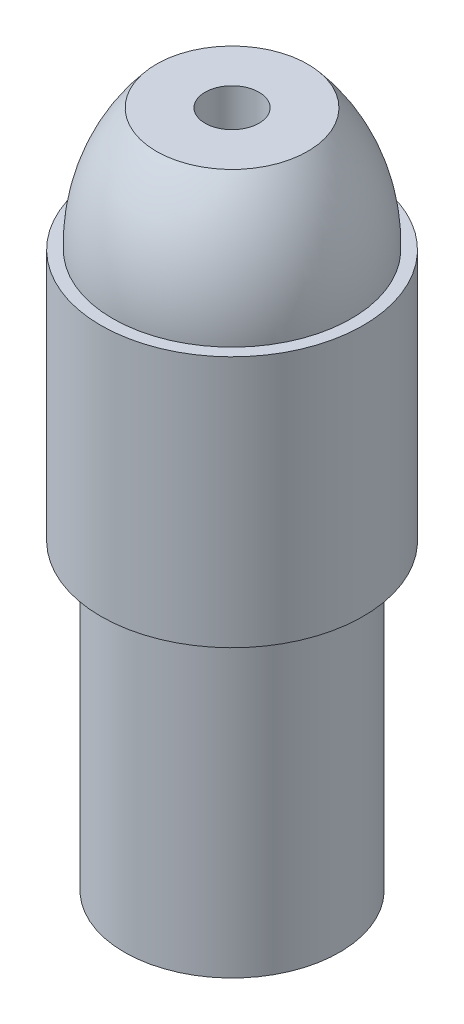
ISO-10303-21;
HEADER;
FILE_DESCRIPTION(('STEP AP214'),'2;1');
FILE_NAME('part.step','',(''),(''),'','','');
FILE_SCHEMA(('AUTOMOTIVE_DESIGN { 1 0 10303 214 1 1 1 1 }'));
ENDSEC;
DATA;
#1=APPLICATION_CONTEXT('core data for automotive mechanical design processes');
#2=APPLICATION_PROTOCOL_DEFINITION('international standard','automotive_design',2000,#1);
#3=PRODUCT_CONTEXT('',#1,'mechanical');
#4=PRODUCT('Part','Part','',(#3));
#5=PRODUCT_RELATED_PRODUCT_CATEGORY('part','',(#4));
#6=PRODUCT_DEFINITION_FORMATION('','',#4);
#7=PRODUCT_DEFINITION_CONTEXT('part definition',#1,'design');
#8=PRODUCT_DEFINITION('design','',#6,#7);
#9=PRODUCT_DEFINITION_SHAPE('','',#8);
#10=(LENGTH_UNIT() NAMED_UNIT(*) SI_UNIT(.MILLI.,.METRE.));
#11=(NAMED_UNIT(*) PLANE_ANGLE_UNIT() SI_UNIT($,.RADIAN.));
#12=(NAMED_UNIT(*) SI_UNIT($,.STERADIAN.) SOLID_ANGLE_UNIT());
#13=UNCERTAINTY_MEASURE_WITH_UNIT(LENGTH_MEASURE(1.E-05),#10,'distance_accuracy_value','');
#14=(GEOMETRIC_REPRESENTATION_CONTEXT(3) GLOBAL_UNCERTAINTY_ASSIGNED_CONTEXT((#13)) GLOBAL_UNIT_ASSIGNED_CONTEXT((#10,
#11,#12)) REPRESENTATION_CONTEXT('',''));
#15=CARTESIAN_POINT('',(0.,0.,0.));
#16=DIRECTION('',(0.,0.,1.));
#17=DIRECTION('',(1.,0.,0.));
#18=AXIS2_PLACEMENT_3D('',#15,#16,#17);
#19=CARTESIAN_POINT('',(0.,29.55,0.));
#20=DIRECTION('',(0.,-1.,0.));
#21=DIRECTION('',(0.,0.,-1.));
#22=AXIS2_PLACEMENT_3D('',#19,#20,#21);
#23=CYLINDRICAL_SURFACE('',#22,5.71795241728915);
#24=CARTESIAN_POINT('',(0.,13.2,0.));
#25=DIRECTION('',(0.,1.,0.));
#26=DIRECTION('',(0.,0.,1.));
#27=AXIS2_PLACEMENT_3D('',#24,#25,#26);
#28=CIRCLE('',#27,5.71795241728915);
#29=CARTESIAN_POINT('',(0.,13.2,5.71795241728915));
#30=VERTEX_POINT('',#29);
#31=EDGE_CURVE('E43',#30,#30,#28,.T.);
#32=ORIENTED_EDGE('',*,*,#31,.T.);
#33=EDGE_LOOP('',(#32));
#34=FACE_BOUND('',#33,.T.);
#35=CARTESIAN_POINT('',(0.,24.186874614579,0.));
#36=DIRECTION('',(0.,1.,0.));
#37=DIRECTION('',(0.,0.,1.));
#38=AXIS2_PLACEMENT_3D('',#35,#36,#37);
#39=CIRCLE('',#38,5.71795241728915);
#40=CARTESIAN_POINT('',(0.,24.186874614579,5.71795241728915));
#41=VERTEX_POINT('',#40);
#42=EDGE_CURVE('E50',#41,#41,#39,.T.);
#43=ORIENTED_EDGE('',*,*,#42,.F.);
#44=EDGE_LOOP('',(#43));
#45=FACE_BOUND('',#44,.T.);
#46=ADVANCED_FACE('F32',(#34,#45),#23,.T.);
#47=CARTESIAN_POINT('',(0.,13.2,0.));
#48=DIRECTION('',(0.,-1.,0.));
#49=DIRECTION('',(0.,0.,-1.));
#50=AXIS2_PLACEMENT_3D('',#47,#48,#49);
#51=CYLINDRICAL_SURFACE('',#50,4.69);
#52=CARTESIAN_POINT('',(0.,13.2,0.));
#53=DIRECTION('',(0.,1.,0.));
#54=DIRECTION('',(0.,0.,1.));
#55=AXIS2_PLACEMENT_3D('',#52,#53,#54);
#56=CIRCLE('',#55,4.69);
#57=CARTESIAN_POINT('',(0.,13.2,4.69));
#58=VERTEX_POINT('',#57);
#59=EDGE_CURVE('E10',#58,#58,#56,.T.);
#60=ORIENTED_EDGE('',*,*,#59,.F.);
#61=EDGE_LOOP('',(#60));
#62=FACE_BOUND('',#61,.T.);
#63=CARTESIAN_POINT('',(0.,0.,0.));
#64=DIRECTION('',(0.,1.,0.));
#65=DIRECTION('',(0.,0.,1.));
#66=AXIS2_PLACEMENT_3D('',#63,#64,#65);
#67=CIRCLE('',#66,4.69);
#68=CARTESIAN_POINT('',(0.,0.,4.69));
#69=VERTEX_POINT('',#68);
#70=EDGE_CURVE('E36',#69,#69,#67,.T.);
#71=ORIENTED_EDGE('',*,*,#70,.T.);
#72=EDGE_LOOP('',(#71));
#73=FACE_BOUND('',#72,.T.);
#74=ADVANCED_FACE('F34',(#62,#73),#51,.T.);
#75=CARTESIAN_POINT('',(0.,0.,0.));
#76=DIRECTION('',(0.,1.,0.));
#77=DIRECTION('',(0.,0.,1.));
#78=AXIS2_PLACEMENT_3D('',#75,#76,#77);
#79=PLANE('',#78);
#80=CARTESIAN_POINT('',(0.,0.,0.));
#81=DIRECTION('',(0.,-1.,0.));
#82=DIRECTION('',(0.,0.,-1.));
#83=AXIS2_PLACEMENT_3D('',#80,#81,#82);
#84=CIRCLE('',#83,1.175);
#85=CARTESIAN_POINT('',(0.,0.,-1.175));
#86=VERTEX_POINT('',#85);
#87=EDGE_CURVE('E57',#86,#86,#84,.T.);
#88=ORIENTED_EDGE('',*,*,#87,.F.);
#89=EDGE_LOOP('',(#88));
#90=FACE_BOUND('',#89,.T.);
#91=ORIENTED_EDGE('',*,*,#70,.F.);
#92=EDGE_LOOP('',(#91));
#93=FACE_BOUND('',#92,.T.);
#94=ADVANCED_FACE('F72',(#90,#93),#79,.F.);
#95=CARTESIAN_POINT('',(0.,13.2,0.));
#96=DIRECTION('',(0.,1.,0.));
#97=DIRECTION('',(0.,0.,1.));
#98=AXIS2_PLACEMENT_3D('',#95,#96,#97);
#99=PLANE('',#98);
#100=ORIENTED_EDGE('',*,*,#31,.F.);
#101=EDGE_LOOP('',(#100));
#102=FACE_BOUND('',#101,.T.);
#103=ORIENTED_EDGE('',*,*,#59,.T.);
#104=EDGE_LOOP('',(#103));
#105=FACE_BOUND('',#104,.T.);
#106=ADVANCED_FACE('F75',(#102,#105),#99,.F.);
#107=CARTESIAN_POINT('',(0.,24.403698872215,0.));
#108=DIRECTION('',(0.,1.,0.));
#109=DIRECTION('',(0.,0.,1.));
#110=AXIS2_PLACEMENT_3D('',#107,#108,#109);
#111=DEGENERATE_TOROIDAL_SURFACE('',#110,2.68685243750601,7.8925721657082,.F.);
#112=CARTESIAN_POINT('',(0.,24.186874614579,0.));
#113=DIRECTION('',(0.,1.,0.));
#114=DIRECTION('',(0.,0.,1.));
#115=AXIS2_PLACEMENT_3D('',#112,#113,#114);
#116=CIRCLE('',#115,5.20274087471309);
#117=CARTESIAN_POINT('',(0.,24.186874614579,5.20274087471309));
#118=VERTEX_POINT('',#117);
#119=EDGE_CURVE('E53',#118,#118,#116,.T.);
#120=ORIENTED_EDGE('',*,*,#119,.T.);
#121=EDGE_LOOP('',(#120));
#122=FACE_BOUND('',#121,.T.);
#123=CARTESIAN_POINT('',(0.,29.55,0.));
#124=DIRECTION('',(0.,1.,0.));
#125=DIRECTION('',(0.,0.,1.));
#126=AXIS2_PLACEMENT_3D('',#123,#124,#125);
#127=CIRCLE('',#126,3.29714957561784);
#128=CARTESIAN_POINT('',(0.,29.55,3.29714957561784));
#129=VERTEX_POINT('',#128);
#130=EDGE_CURVE('E47',#129,#129,#127,.T.);
#131=ORIENTED_EDGE('',*,*,#130,.F.);
#132=EDGE_LOOP('',(#131));
#133=FACE_BOUND('',#132,.T.);
#134=ADVANCED_FACE('F91',(#122,#133),#111,.F.);
#135=CARTESIAN_POINT('',(5.71795241728915,24.186874614579,0.));
#136=DIRECTION('',(0.,1.,0.));
#137=DIRECTION('',(0.,0.,1.));
#138=AXIS2_PLACEMENT_3D('',#135,#136,#137);
#139=PLANE('',#138);
#140=ORIENTED_EDGE('',*,*,#42,.T.);
#141=EDGE_LOOP('',(#140));
#142=FACE_BOUND('',#141,.T.);
#143=ORIENTED_EDGE('',*,*,#119,.F.);
#144=EDGE_LOOP('',(#143));
#145=FACE_BOUND('',#144,.T.);
#146=ADVANCED_FACE('F95',(#142,#145),#139,.T.);
#147=CARTESIAN_POINT('',(0.,29.55,0.));
#148=DIRECTION('',(0.,1.,0.));
#149=DIRECTION('',(0.,0.,1.));
#150=AXIS2_PLACEMENT_3D('',#147,#148,#149);
#151=PLANE('',#150);
#152=CARTESIAN_POINT('',(0.,29.55,0.));
#153=DIRECTION('',(0.,-1.,0.));
#154=DIRECTION('',(0.,0.,-1.));
#155=AXIS2_PLACEMENT_3D('',#152,#153,#154);
#156=CIRCLE('',#155,1.175);
#157=CARTESIAN_POINT('',(0.,29.55,-1.175));
#158=VERTEX_POINT('',#157);
#159=EDGE_CURVE('E56',#158,#158,#156,.T.);
#160=ORIENTED_EDGE('',*,*,#159,.T.);
#161=EDGE_LOOP('',(#160));
#162=FACE_BOUND('',#161,.T.);
#163=ORIENTED_EDGE('',*,*,#130,.T.);
#164=EDGE_LOOP('',(#163));
#165=FACE_BOUND('',#164,.T.);
#166=ADVANCED_FACE('F63',(#162,#165),#151,.T.);
#167=CARTESIAN_POINT('',(0.,29.55,0.));
#168=DIRECTION('',(0.,-1.,0.));
#169=DIRECTION('',(0.,0.,-1.));
#170=AXIS2_PLACEMENT_3D('',#167,#168,#169);
#171=CYLINDRICAL_SURFACE('',#170,1.175);
#172=ORIENTED_EDGE('',*,*,#159,.F.);
#173=EDGE_LOOP('',(#172));
#174=FACE_BOUND('',#173,.T.);
#175=ORIENTED_EDGE('',*,*,#87,.T.);
#176=EDGE_LOOP('',(#175));
#177=FACE_BOUND('',#176,.T.);
#178=ADVANCED_FACE('F66',(#174,#177),#171,.F.);
#179=CLOSED_SHELL('',(#46,#74,#94,#106,#134,#146,#166,#178));
#180=MANIFOLD_SOLID_BREP('B2',#179);
#181=ADVANCED_BREP_SHAPE_REPRESENTATION('',(#18,#180),#14);
#182=SHAPE_DEFINITION_REPRESENTATION(#9,#181);
ENDSEC;
END-ISO-10303-21;
